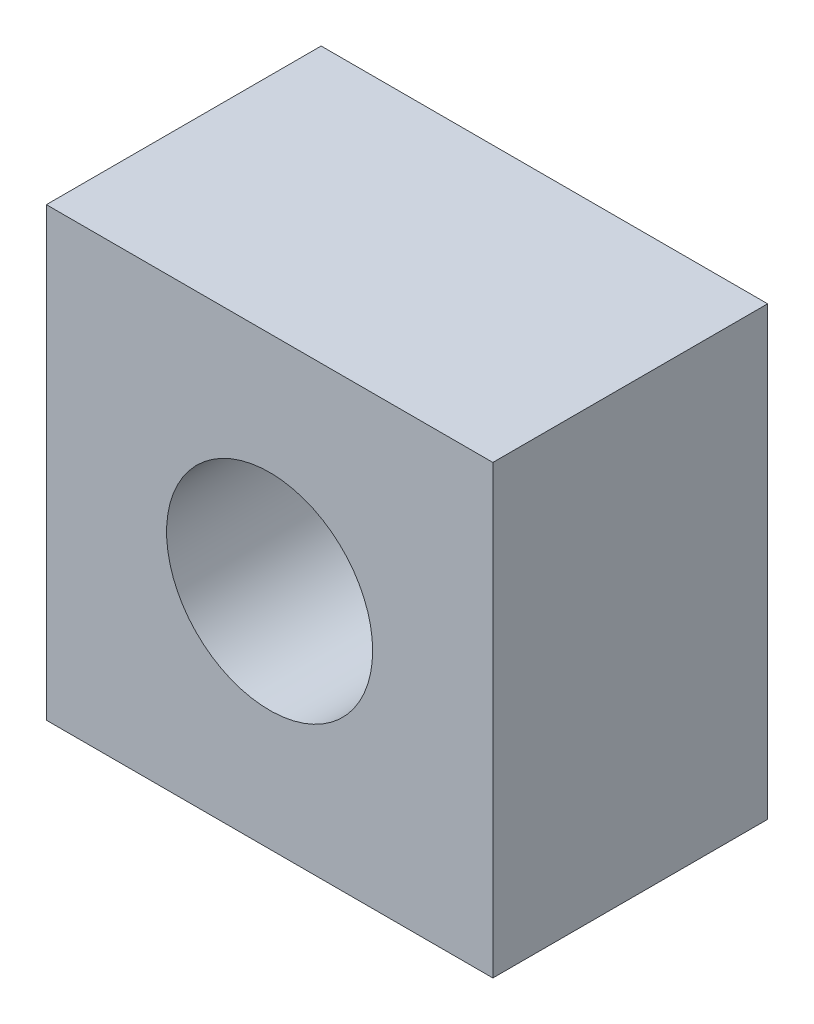
ISO-10303-21;
HEADER;
FILE_DESCRIPTION(('STEP AP214'),'2;1');
FILE_NAME('part.step','',(''),(''),'','','');
FILE_SCHEMA(('AUTOMOTIVE_DESIGN { 1 0 10303 214 1 1 1 1 }'));
ENDSEC;
DATA;
#1=APPLICATION_CONTEXT('core data for automotive mechanical design processes');
#2=APPLICATION_PROTOCOL_DEFINITION('international standard','automotive_design',2000,#1);
#3=PRODUCT_CONTEXT('',#1,'mechanical');
#4=PRODUCT('Part','Part','',(#3));
#5=PRODUCT_RELATED_PRODUCT_CATEGORY('part','',(#4));
#6=PRODUCT_DEFINITION_FORMATION('','',#4);
#7=PRODUCT_DEFINITION_CONTEXT('part definition',#1,'design');
#8=PRODUCT_DEFINITION('design','',#6,#7);
#9=PRODUCT_DEFINITION_SHAPE('','',#8);
#10=(LENGTH_UNIT() NAMED_UNIT(*) SI_UNIT(.MILLI.,.METRE.));
#11=(NAMED_UNIT(*) PLANE_ANGLE_UNIT() SI_UNIT($,.RADIAN.));
#12=(NAMED_UNIT(*) SI_UNIT($,.STERADIAN.) SOLID_ANGLE_UNIT());
#13=UNCERTAINTY_MEASURE_WITH_UNIT(LENGTH_MEASURE(1.E-05),#10,'distance_accuracy_value','');
#14=(GEOMETRIC_REPRESENTATION_CONTEXT(3) GLOBAL_UNCERTAINTY_ASSIGNED_CONTEXT((#13)) GLOBAL_UNIT_ASSIGNED_CONTEXT((#10,
#11,#12)) REPRESENTATION_CONTEXT('',''));
#15=CARTESIAN_POINT('',(0.,0.,0.));
#16=DIRECTION('',(0.,0.,1.));
#17=DIRECTION('',(1.,0.,0.));
#18=AXIS2_PLACEMENT_3D('',#15,#16,#17);
#19=CARTESIAN_POINT('',(0.,0.,8.));
#20=DIRECTION('',(-1.,0.,0.));
#21=DIRECTION('',(0.,0.,1.));
#22=AXIS2_PLACEMENT_3D('',#19,#20,#21);
#23=PLANE('',#22);
#24=DIRECTION('',(0.,1.,0.));
#25=VECTOR('',#24,1.);
#26=CARTESIAN_POINT('',(0.,0.,0.));
#27=LINE('',#26,#25);
#28=CARTESIAN_POINT('',(0.,0.,0.));
#29=VERTEX_POINT('',#28);
#30=CARTESIAN_POINT('',(0.,13.,0.));
#31=VERTEX_POINT('',#30);
#32=EDGE_CURVE('E110',#29,#31,#27,.T.);
#33=ORIENTED_EDGE('',*,*,#32,.F.);
#34=DIRECTION('',(0.,0.,-1.));
#35=VECTOR('',#34,1.);
#36=CARTESIAN_POINT('',(0.,0.,8.));
#37=LINE('',#36,#35);
#38=CARTESIAN_POINT('',(0.,0.,8.));
#39=VERTEX_POINT('',#38);
#40=EDGE_CURVE('E11',#39,#29,#37,.T.);
#41=ORIENTED_EDGE('',*,*,#40,.F.);
#42=DIRECTION('',(0.,1.,0.));
#43=VECTOR('',#42,1.);
#44=CARTESIAN_POINT('',(0.,0.,8.));
#45=LINE('',#44,#43);
#46=CARTESIAN_POINT('',(0.,13.,8.));
#47=VERTEX_POINT('',#46);
#48=EDGE_CURVE('E102',#39,#47,#45,.T.);
#49=ORIENTED_EDGE('',*,*,#48,.T.);
#50=DIRECTION('',(0.,0.,-1.));
#51=VECTOR('',#50,1.);
#52=CARTESIAN_POINT('',(0.,13.,8.));
#53=LINE('',#52,#51);
#54=EDGE_CURVE('E41',#47,#31,#53,.T.);
#55=ORIENTED_EDGE('',*,*,#54,.T.);
#56=EDGE_LOOP('',(#33,#41,#49,#55));
#57=FACE_BOUND('',#56,.T.);
#58=ADVANCED_FACE('F38',(#57),#23,.T.);
#59=CARTESIAN_POINT('',(0.,0.,8.));
#60=DIRECTION('',(0.,1.,0.));
#61=DIRECTION('',(0.,0.,1.));
#62=AXIS2_PLACEMENT_3D('',#59,#60,#61);
#63=PLANE('',#62);
#64=DIRECTION('',(1.,0.,0.));
#65=VECTOR('',#64,1.);
#66=CARTESIAN_POINT('',(0.,0.,0.));
#67=LINE('',#66,#65);
#68=CARTESIAN_POINT('',(13.,0.,0.));
#69=VERTEX_POINT('',#68);
#70=EDGE_CURVE('E72',#29,#69,#67,.T.);
#71=ORIENTED_EDGE('',*,*,#70,.T.);
#72=DIRECTION('',(0.,0.,-1.));
#73=VECTOR('',#72,1.);
#74=CARTESIAN_POINT('',(13.,0.,8.));
#75=LINE('',#74,#73);
#76=CARTESIAN_POINT('',(13.,0.,8.));
#77=VERTEX_POINT('',#76);
#78=EDGE_CURVE('E48',#77,#69,#75,.T.);
#79=ORIENTED_EDGE('',*,*,#78,.F.);
#80=DIRECTION('',(1.,0.,0.));
#81=VECTOR('',#80,1.);
#82=CARTESIAN_POINT('',(0.,0.,8.));
#83=LINE('',#82,#81);
#84=EDGE_CURVE('E89',#39,#77,#83,.T.);
#85=ORIENTED_EDGE('',*,*,#84,.F.);
#86=ORIENTED_EDGE('',*,*,#40,.T.);
#87=EDGE_LOOP('',(#71,#79,#85,#86));
#88=FACE_BOUND('',#87,.T.);
#89=ADVANCED_FACE('F127',(#88),#63,.F.);
#90=CARTESIAN_POINT('',(13.,0.,8.));
#91=DIRECTION('',(-1.,0.,0.));
#92=DIRECTION('',(0.,-1.,0.));
#93=AXIS2_PLACEMENT_3D('',#90,#91,#92);
#94=PLANE('',#93);
#95=DIRECTION('',(0.,1.,0.));
#96=VECTOR('',#95,1.);
#97=CARTESIAN_POINT('',(13.,0.,0.));
#98=LINE('',#97,#96);
#99=CARTESIAN_POINT('',(13.,13.,0.));
#100=VERTEX_POINT('',#99);
#101=EDGE_CURVE('E97',#69,#100,#98,.T.);
#102=ORIENTED_EDGE('',*,*,#101,.T.);
#103=DIRECTION('',(0.,0.,-1.));
#104=VECTOR('',#103,1.);
#105=CARTESIAN_POINT('',(13.,13.,8.));
#106=LINE('',#105,#104);
#107=CARTESIAN_POINT('',(13.,13.,8.));
#108=VERTEX_POINT('',#107);
#109=EDGE_CURVE('E94',#108,#100,#106,.T.);
#110=ORIENTED_EDGE('',*,*,#109,.F.);
#111=DIRECTION('',(0.,1.,0.));
#112=VECTOR('',#111,1.);
#113=CARTESIAN_POINT('',(13.,0.,8.));
#114=LINE('',#113,#112);
#115=EDGE_CURVE('E84',#77,#108,#114,.T.);
#116=ORIENTED_EDGE('',*,*,#115,.F.);
#117=ORIENTED_EDGE('',*,*,#78,.T.);
#118=EDGE_LOOP('',(#102,#110,#116,#117));
#119=FACE_BOUND('',#118,.T.);
#120=ADVANCED_FACE('F95',(#119),#94,.F.);
#121=CARTESIAN_POINT('',(0.,13.,8.));
#122=DIRECTION('',(0.,1.,0.));
#123=DIRECTION('',(0.,0.,1.));
#124=AXIS2_PLACEMENT_3D('',#121,#122,#123);
#125=PLANE('',#124);
#126=DIRECTION('',(1.,0.,0.));
#127=VECTOR('',#126,1.);
#128=CARTESIAN_POINT('',(0.,13.,0.));
#129=LINE('',#128,#127);
#130=EDGE_CURVE('E114',#31,#100,#129,.T.);
#131=ORIENTED_EDGE('',*,*,#130,.F.);
#132=ORIENTED_EDGE('',*,*,#54,.F.);
#133=DIRECTION('',(1.,0.,0.));
#134=VECTOR('',#133,1.);
#135=CARTESIAN_POINT('',(0.,13.,8.));
#136=LINE('',#135,#134);
#137=EDGE_CURVE('E88',#47,#108,#136,.T.);
#138=ORIENTED_EDGE('',*,*,#137,.T.);
#139=ORIENTED_EDGE('',*,*,#109,.T.);
#140=EDGE_LOOP('',(#131,#132,#138,#139));
#141=FACE_BOUND('',#140,.T.);
#142=ADVANCED_FACE('F100',(#141),#125,.T.);
#143=CARTESIAN_POINT('',(0.,0.,8.));
#144=DIRECTION('',(0.,0.,-1.));
#145=DIRECTION('',(-1.,0.,0.));
#146=AXIS2_PLACEMENT_3D('',#143,#144,#145);
#147=PLANE('',#146);
#148=CARTESIAN_POINT('',(6.5,6.5,8.));
#149=DIRECTION('',(0.,0.,1.));
#150=DIRECTION('',(1.,0.,0.));
#151=AXIS2_PLACEMENT_3D('',#148,#149,#150);
#152=CIRCLE('',#151,3.);
#153=CARTESIAN_POINT('',(9.5,6.5,8.));
#154=VERTEX_POINT('',#153);
#155=EDGE_CURVE('E159',#154,#154,#152,.T.);
#156=ORIENTED_EDGE('',*,*,#155,.F.);
#157=EDGE_LOOP('',(#156));
#158=FACE_BOUND('',#157,.T.);
#159=ORIENTED_EDGE('',*,*,#48,.F.);
#160=ORIENTED_EDGE('',*,*,#84,.T.);
#161=ORIENTED_EDGE('',*,*,#115,.T.);
#162=ORIENTED_EDGE('',*,*,#137,.F.);
#163=EDGE_LOOP('',(#159,#160,#161,#162));
#164=FACE_BOUND('',#163,.T.);
#165=ADVANCED_FACE('F87',(#158,#164),#147,.F.);
#166=CARTESIAN_POINT('',(0.,0.,0.));
#167=DIRECTION('',(0.,0.,-1.));
#168=DIRECTION('',(-1.,0.,0.));
#169=AXIS2_PLACEMENT_3D('',#166,#167,#168);
#170=PLANE('',#169);
#171=CARTESIAN_POINT('',(6.5,6.5,0.));
#172=DIRECTION('',(0.,0.,1.));
#173=DIRECTION('',(1.,0.,0.));
#174=AXIS2_PLACEMENT_3D('',#171,#172,#173);
#175=CIRCLE('',#174,3.);
#176=CARTESIAN_POINT('',(9.5,6.5,0.));
#177=VERTEX_POINT('',#176);
#178=EDGE_CURVE('E115',#177,#177,#175,.T.);
#179=ORIENTED_EDGE('',*,*,#178,.T.);
#180=EDGE_LOOP('',(#179));
#181=FACE_BOUND('',#180,.T.);
#182=ORIENTED_EDGE('',*,*,#32,.T.);
#183=ORIENTED_EDGE('',*,*,#130,.T.);
#184=ORIENTED_EDGE('',*,*,#101,.F.);
#185=ORIENTED_EDGE('',*,*,#70,.F.);
#186=EDGE_LOOP('',(#182,#183,#184,#185));
#187=FACE_BOUND('',#186,.T.);
#188=ADVANCED_FACE('F124',(#181,#187),#170,.T.);
#189=CARTESIAN_POINT('',(6.5,6.5,0.));
#190=DIRECTION('',(0.,0.,1.));
#191=DIRECTION('',(1.,0.,0.));
#192=AXIS2_PLACEMENT_3D('',#189,#190,#191);
#193=CYLINDRICAL_SURFACE('',#192,3.);
#194=ORIENTED_EDGE('',*,*,#178,.F.);
#195=EDGE_LOOP('',(#194));
#196=FACE_BOUND('',#195,.T.);
#197=ORIENTED_EDGE('',*,*,#155,.T.);
#198=EDGE_LOOP('',(#197));
#199=FACE_BOUND('',#198,.T.);
#200=ADVANCED_FACE('F146',(#196,#199),#193,.F.);
#201=CLOSED_SHELL('',(#58,#89,#120,#142,#165,#188,#200));
#202=MANIFOLD_SOLID_BREP('B2',#201);
#203=ADVANCED_BREP_SHAPE_REPRESENTATION('',(#18,#202),#14);
#204=SHAPE_DEFINITION_REPRESENTATION(#9,#203);
ENDSEC;
END-ISO-10303-21;
